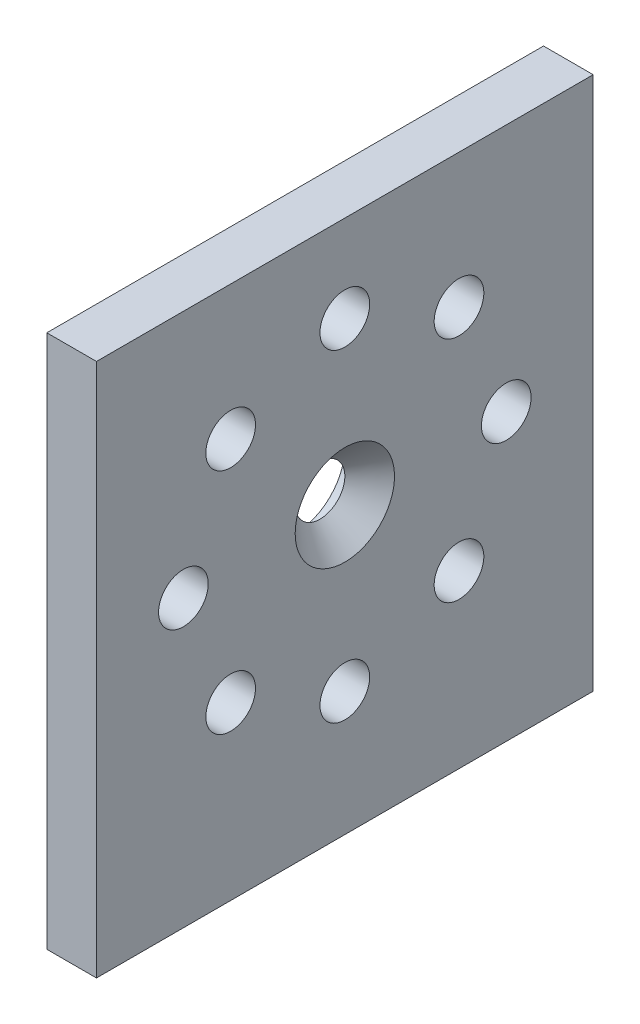
ISO-10303-21;
HEADER;
FILE_DESCRIPTION(('STEP AP214'),'2;1');
FILE_NAME('part.step','',(''),(''),'','','');
FILE_SCHEMA(('AUTOMOTIVE_DESIGN { 1 0 10303 214 1 1 1 1 }'));
ENDSEC;
DATA;
#1=APPLICATION_CONTEXT('core data for automotive mechanical design processes');
#2=APPLICATION_PROTOCOL_DEFINITION('international standard','automotive_design',2000,#1);
#3=PRODUCT_CONTEXT('',#1,'mechanical');
#4=PRODUCT('Part','Part','',(#3));
#5=PRODUCT_RELATED_PRODUCT_CATEGORY('part','',(#4));
#6=PRODUCT_DEFINITION_FORMATION('','',#4);
#7=PRODUCT_DEFINITION_CONTEXT('part definition',#1,'design');
#8=PRODUCT_DEFINITION('design','',#6,#7);
#9=PRODUCT_DEFINITION_SHAPE('','',#8);
#10=(LENGTH_UNIT() NAMED_UNIT(*) SI_UNIT(.MILLI.,.METRE.));
#11=(NAMED_UNIT(*) PLANE_ANGLE_UNIT() SI_UNIT($,.RADIAN.));
#12=(NAMED_UNIT(*) SI_UNIT($,.STERADIAN.) SOLID_ANGLE_UNIT());
#13=UNCERTAINTY_MEASURE_WITH_UNIT(LENGTH_MEASURE(1.E-05),#10,'distance_accuracy_value','');
#14=(GEOMETRIC_REPRESENTATION_CONTEXT(3) GLOBAL_UNCERTAINTY_ASSIGNED_CONTEXT((#13)) GLOBAL_UNIT_ASSIGNED_CONTEXT((#10,
#11,#12)) REPRESENTATION_CONTEXT('',''));
#15=CARTESIAN_POINT('',(0.,0.,0.));
#16=DIRECTION('',(0.,0.,1.));
#17=DIRECTION('',(1.,0.,0.));
#18=AXIS2_PLACEMENT_3D('',#15,#16,#17);
#19=CARTESIAN_POINT('',(0.,0.,40.));
#20=DIRECTION('',(0.,1.,0.));
#21=DIRECTION('',(0.,0.,1.));
#22=AXIS2_PLACEMENT_3D('',#19,#20,#21);
#23=PLANE('',#22);
#24=DIRECTION('',(1.,0.,0.));
#25=VECTOR('',#24,1.);
#26=CARTESIAN_POINT('',(0.,0.,0.));
#27=LINE('',#26,#25);
#28=CARTESIAN_POINT('',(0.,0.,0.));
#29=VERTEX_POINT('',#28);
#30=CARTESIAN_POINT('',(4.,0.,0.));
#31=VERTEX_POINT('',#30);
#32=EDGE_CURVE('E98',#29,#31,#27,.T.);
#33=ORIENTED_EDGE('',*,*,#32,.T.);
#34=DIRECTION('',(0.,0.,-1.));
#35=VECTOR('',#34,1.);
#36=CARTESIAN_POINT('',(4.,0.,40.));
#37=LINE('',#36,#35);
#38=CARTESIAN_POINT('',(4.,0.,40.));
#39=VERTEX_POINT('',#38);
#40=EDGE_CURVE('E40',#39,#31,#37,.T.);
#41=ORIENTED_EDGE('',*,*,#40,.F.);
#42=DIRECTION('',(1.,0.,0.));
#43=VECTOR('',#42,1.);
#44=CARTESIAN_POINT('',(0.,0.,40.));
#45=LINE('',#44,#43);
#46=CARTESIAN_POINT('',(0.,0.,40.));
#47=VERTEX_POINT('',#46);
#48=EDGE_CURVE('E84',#47,#39,#45,.T.);
#49=ORIENTED_EDGE('',*,*,#48,.F.);
#50=DIRECTION('',(0.,0.,-1.));
#51=VECTOR('',#50,1.);
#52=CARTESIAN_POINT('',(0.,0.,40.));
#53=LINE('',#52,#51);
#54=EDGE_CURVE('E94',#47,#29,#53,.T.);
#55=ORIENTED_EDGE('',*,*,#54,.T.);
#56=EDGE_LOOP('',(#33,#41,#49,#55));
#57=FACE_BOUND('',#56,.T.);
#58=ADVANCED_FACE('F31',(#57),#23,.F.);
#59=CARTESIAN_POINT('',(4.,0.,40.));
#60=DIRECTION('',(-1.,0.,0.));
#61=DIRECTION('',(0.,0.,1.));
#62=AXIS2_PLACEMENT_3D('',#59,#60,#61);
#63=PLANE('',#62);
#64=CARTESIAN_POINT('',(4.,23.,20.));
#65=DIRECTION('',(-1.,0.,0.));
#66=DIRECTION('',(0.,0.,1.));
#67=AXIS2_PLACEMENT_3D('',#64,#65,#66);
#68=CIRCLE('',#67,4.);
#69=CARTESIAN_POINT('',(4.,23.,24.));
#70=VERTEX_POINT('',#69);
#71=EDGE_CURVE('E11',#70,#70,#68,.T.);
#72=ORIENTED_EDGE('',*,*,#71,.T.);
#73=EDGE_LOOP('',(#72));
#74=FACE_BOUND('',#73,.T.);
#75=CARTESIAN_POINT('',(4.,32.1923881554251,10.8076118445749));
#76=DIRECTION('',(-1.,0.,0.));
#77=DIRECTION('',(0.,0.,1.));
#78=AXIS2_PLACEMENT_3D('',#75,#76,#77);
#79=CIRCLE('',#78,2.00000000000001);
#80=CARTESIAN_POINT('',(4.,32.1923881554251,12.8076118445749));
#81=VERTEX_POINT('',#80);
#82=EDGE_CURVE('E114',#81,#81,#79,.T.);
#83=ORIENTED_EDGE('',*,*,#82,.T.);
#84=EDGE_LOOP('',(#83));
#85=FACE_BOUND('',#84,.T.);
#86=CARTESIAN_POINT('',(4.,23.,7.));
#87=DIRECTION('',(-1.,0.,0.));
#88=DIRECTION('',(0.,0.,1.));
#89=AXIS2_PLACEMENT_3D('',#86,#87,#88);
#90=CIRCLE('',#89,2.);
#91=CARTESIAN_POINT('',(4.,23.,8.99999999999999));
#92=VERTEX_POINT('',#91);
#93=EDGE_CURVE('E127',#92,#92,#90,.T.);
#94=ORIENTED_EDGE('',*,*,#93,.T.);
#95=EDGE_LOOP('',(#94));
#96=FACE_BOUND('',#95,.T.);
#97=CARTESIAN_POINT('',(4.,13.8076118445749,10.8076118445749));
#98=DIRECTION('',(-1.,0.,0.));
#99=DIRECTION('',(0.,0.,1.));
#100=AXIS2_PLACEMENT_3D('',#97,#98,#99);
#101=CIRCLE('',#100,2.);
#102=CARTESIAN_POINT('',(4.,13.8076118445749,12.8076118445749));
#103=VERTEX_POINT('',#102);
#104=EDGE_CURVE('E133',#103,#103,#101,.T.);
#105=ORIENTED_EDGE('',*,*,#104,.T.);
#106=EDGE_LOOP('',(#105));
#107=FACE_BOUND('',#106,.T.);
#108=CARTESIAN_POINT('',(4.,9.99999999999999,20.));
#109=DIRECTION('',(-1.,0.,0.));
#110=DIRECTION('',(0.,0.,1.));
#111=AXIS2_PLACEMENT_3D('',#108,#109,#110);
#112=CIRCLE('',#111,2.00000000000001);
#113=CARTESIAN_POINT('',(4.,9.99999999999999,22.));
#114=VERTEX_POINT('',#113);
#115=EDGE_CURVE('E139',#114,#114,#112,.T.);
#116=ORIENTED_EDGE('',*,*,#115,.T.);
#117=EDGE_LOOP('',(#116));
#118=FACE_BOUND('',#117,.T.);
#119=CARTESIAN_POINT('',(4.,13.8076118445749,29.1923881554251));
#120=DIRECTION('',(-1.,0.,0.));
#121=DIRECTION('',(0.,0.,1.));
#122=AXIS2_PLACEMENT_3D('',#119,#120,#121);
#123=CIRCLE('',#122,2.00000000000001);
#124=CARTESIAN_POINT('',(4.,13.8076118445749,31.1923881554251));
#125=VERTEX_POINT('',#124);
#126=EDGE_CURVE('E145',#125,#125,#123,.T.);
#127=ORIENTED_EDGE('',*,*,#126,.T.);
#128=EDGE_LOOP('',(#127));
#129=FACE_BOUND('',#128,.T.);
#130=CARTESIAN_POINT('',(4.,23.,33.));
#131=DIRECTION('',(-1.,0.,0.));
#132=DIRECTION('',(0.,0.,1.));
#133=AXIS2_PLACEMENT_3D('',#130,#131,#132);
#134=CIRCLE('',#133,2.);
#135=CARTESIAN_POINT('',(4.,23.,35.));
#136=VERTEX_POINT('',#135);
#137=EDGE_CURVE('E151',#136,#136,#134,.T.);
#138=ORIENTED_EDGE('',*,*,#137,.T.);
#139=EDGE_LOOP('',(#138));
#140=FACE_BOUND('',#139,.T.);
#141=CARTESIAN_POINT('',(4.,32.1923881554251,29.1923881554251));
#142=DIRECTION('',(-1.,0.,0.));
#143=DIRECTION('',(0.,0.,1.));
#144=AXIS2_PLACEMENT_3D('',#141,#142,#143);
#145=CIRCLE('',#144,2.);
#146=CARTESIAN_POINT('',(4.,32.1923881554251,31.1923881554251));
#147=VERTEX_POINT('',#146);
#148=EDGE_CURVE('E157',#147,#147,#145,.T.);
#149=ORIENTED_EDGE('',*,*,#148,.T.);
#150=EDGE_LOOP('',(#149));
#151=FACE_BOUND('',#150,.T.);
#152=CARTESIAN_POINT('',(4.,36.,20.));
#153=DIRECTION('',(-1.,0.,0.));
#154=DIRECTION('',(0.,0.,1.));
#155=AXIS2_PLACEMENT_3D('',#152,#153,#154);
#156=CIRCLE('',#155,2.);
#157=CARTESIAN_POINT('',(4.,36.,22.));
#158=VERTEX_POINT('',#157);
#159=EDGE_CURVE('E101',#158,#158,#156,.T.);
#160=ORIENTED_EDGE('',*,*,#159,.T.);
#161=EDGE_LOOP('',(#160));
#162=FACE_BOUND('',#161,.T.);
#163=DIRECTION('',(0.,1.,0.));
#164=VECTOR('',#163,1.);
#165=CARTESIAN_POINT('',(4.,0.,0.));
#166=LINE('',#165,#164);
#167=CARTESIAN_POINT('',(4.,43.,0.));
#168=VERTEX_POINT('',#167);
#169=EDGE_CURVE('E89',#31,#168,#166,.T.);
#170=ORIENTED_EDGE('',*,*,#169,.T.);
#171=DIRECTION('',(0.,0.,-1.));
#172=VECTOR('',#171,1.);
#173=CARTESIAN_POINT('',(4.,43.,40.));
#174=LINE('',#173,#172);
#175=CARTESIAN_POINT('',(4.,43.,40.));
#176=VERTEX_POINT('',#175);
#177=EDGE_CURVE('E87',#176,#168,#174,.T.);
#178=ORIENTED_EDGE('',*,*,#177,.F.);
#179=DIRECTION('',(0.,1.,0.));
#180=VECTOR('',#179,1.);
#181=CARTESIAN_POINT('',(4.,0.,40.));
#182=LINE('',#181,#180);
#183=EDGE_CURVE('E79',#39,#176,#182,.T.);
#184=ORIENTED_EDGE('',*,*,#183,.F.);
#185=ORIENTED_EDGE('',*,*,#40,.T.);
#186=EDGE_LOOP('',(#170,#178,#184,#185));
#187=FACE_BOUND('',#186,.T.);
#188=ADVANCED_FACE('F88',(#74,#85,#96,#107,#118,#129,#140,#151,#162,#187),#63,.F.);
#189=CARTESIAN_POINT('',(4.,43.,40.));
#190=DIRECTION('',(0.,-1.,0.));
#191=DIRECTION('',(0.,0.,-1.));
#192=AXIS2_PLACEMENT_3D('',#189,#190,#191);
#193=PLANE('',#192);
#194=DIRECTION('',(-1.,0.,0.));
#195=VECTOR('',#194,1.);
#196=CARTESIAN_POINT('',(4.,43.,0.));
#197=LINE('',#196,#195);
#198=CARTESIAN_POINT('',(0.,43.,0.));
#199=VERTEX_POINT('',#198);
#200=EDGE_CURVE('E65',#168,#199,#197,.T.);
#201=ORIENTED_EDGE('',*,*,#200,.T.);
#202=DIRECTION('',(0.,0.,-1.));
#203=VECTOR('',#202,1.);
#204=CARTESIAN_POINT('',(0.,43.,40.));
#205=LINE('',#204,#203);
#206=CARTESIAN_POINT('',(0.,43.,40.));
#207=VERTEX_POINT('',#206);
#208=EDGE_CURVE('E90',#207,#199,#205,.T.);
#209=ORIENTED_EDGE('',*,*,#208,.F.);
#210=DIRECTION('',(-1.,0.,0.));
#211=VECTOR('',#210,1.);
#212=CARTESIAN_POINT('',(4.,43.,40.));
#213=LINE('',#212,#211);
#214=EDGE_CURVE('E82',#176,#207,#213,.T.);
#215=ORIENTED_EDGE('',*,*,#214,.F.);
#216=ORIENTED_EDGE('',*,*,#177,.T.);
#217=EDGE_LOOP('',(#201,#209,#215,#216));
#218=FACE_BOUND('',#217,.T.);
#219=ADVANCED_FACE('F92',(#218),#193,.F.);
#220=CARTESIAN_POINT('',(0.,0.,40.));
#221=DIRECTION('',(1.,0.,0.));
#222=DIRECTION('',(0.,0.,-1.));
#223=AXIS2_PLACEMENT_3D('',#220,#221,#222);
#224=PLANE('',#223);
#225=CARTESIAN_POINT('',(0.,23.,20.));
#226=DIRECTION('',(-1.,0.,0.));
#227=DIRECTION('',(0.,0.,1.));
#228=AXIS2_PLACEMENT_3D('',#225,#226,#227);
#229=CIRCLE('',#228,4.);
#230=CARTESIAN_POINT('',(0.,23.,24.));
#231=VERTEX_POINT('',#230);
#232=EDGE_CURVE('E117',#231,#231,#229,.T.);
#233=ORIENTED_EDGE('',*,*,#232,.F.);
#234=EDGE_LOOP('',(#233));
#235=FACE_BOUND('',#234,.T.);
#236=CARTESIAN_POINT('',(0.,32.1923881554251,10.8076118445749));
#237=DIRECTION('',(-1.,0.,0.));
#238=DIRECTION('',(0.,0.,1.));
#239=AXIS2_PLACEMENT_3D('',#236,#237,#238);
#240=CIRCLE('',#239,2.00000000000001);
#241=CARTESIAN_POINT('',(0.,32.1923881554251,12.8076118445749));
#242=VERTEX_POINT('',#241);
#243=EDGE_CURVE('E109',#242,#242,#240,.T.);
#244=ORIENTED_EDGE('',*,*,#243,.F.);
#245=EDGE_LOOP('',(#244));
#246=FACE_BOUND('',#245,.T.);
#247=CARTESIAN_POINT('',(0.,23.,7.));
#248=DIRECTION('',(-1.,0.,0.));
#249=DIRECTION('',(0.,0.,1.));
#250=AXIS2_PLACEMENT_3D('',#247,#248,#249);
#251=CIRCLE('',#250,2.);
#252=CARTESIAN_POINT('',(0.,23.,8.99999999999999));
#253=VERTEX_POINT('',#252);
#254=EDGE_CURVE('E125',#253,#253,#251,.T.);
#255=ORIENTED_EDGE('',*,*,#254,.F.);
#256=EDGE_LOOP('',(#255));
#257=FACE_BOUND('',#256,.T.);
#258=CARTESIAN_POINT('',(0.,13.8076118445749,10.8076118445749));
#259=DIRECTION('',(-1.,0.,0.));
#260=DIRECTION('',(0.,0.,1.));
#261=AXIS2_PLACEMENT_3D('',#258,#259,#260);
#262=CIRCLE('',#261,2.);
#263=CARTESIAN_POINT('',(0.,13.8076118445749,12.8076118445749));
#264=VERTEX_POINT('',#263);
#265=EDGE_CURVE('E130',#264,#264,#262,.T.);
#266=ORIENTED_EDGE('',*,*,#265,.F.);
#267=EDGE_LOOP('',(#266));
#268=FACE_BOUND('',#267,.T.);
#269=CARTESIAN_POINT('',(0.,9.99999999999999,20.));
#270=DIRECTION('',(-1.,0.,0.));
#271=DIRECTION('',(0.,0.,1.));
#272=AXIS2_PLACEMENT_3D('',#269,#270,#271);
#273=CIRCLE('',#272,2.00000000000001);
#274=CARTESIAN_POINT('',(0.,9.99999999999999,22.));
#275=VERTEX_POINT('',#274);
#276=EDGE_CURVE('E136',#275,#275,#273,.T.);
#277=ORIENTED_EDGE('',*,*,#276,.F.);
#278=EDGE_LOOP('',(#277));
#279=FACE_BOUND('',#278,.T.);
#280=CARTESIAN_POINT('',(0.,13.8076118445749,29.1923881554251));
#281=DIRECTION('',(-1.,0.,0.));
#282=DIRECTION('',(0.,0.,1.));
#283=AXIS2_PLACEMENT_3D('',#280,#281,#282);
#284=CIRCLE('',#283,2.00000000000001);
#285=CARTESIAN_POINT('',(0.,13.8076118445749,31.1923881554251));
#286=VERTEX_POINT('',#285);
#287=EDGE_CURVE('E142',#286,#286,#284,.T.);
#288=ORIENTED_EDGE('',*,*,#287,.F.);
#289=EDGE_LOOP('',(#288));
#290=FACE_BOUND('',#289,.T.);
#291=CARTESIAN_POINT('',(0.,23.,33.));
#292=DIRECTION('',(-1.,0.,0.));
#293=DIRECTION('',(0.,0.,1.));
#294=AXIS2_PLACEMENT_3D('',#291,#292,#293);
#295=CIRCLE('',#294,2.);
#296=CARTESIAN_POINT('',(0.,23.,35.));
#297=VERTEX_POINT('',#296);
#298=EDGE_CURVE('E148',#297,#297,#295,.T.);
#299=ORIENTED_EDGE('',*,*,#298,.F.);
#300=EDGE_LOOP('',(#299));
#301=FACE_BOUND('',#300,.T.);
#302=CARTESIAN_POINT('',(0.,32.1923881554251,29.1923881554251));
#303=DIRECTION('',(-1.,0.,0.));
#304=DIRECTION('',(0.,0.,1.));
#305=AXIS2_PLACEMENT_3D('',#302,#303,#304);
#306=CIRCLE('',#305,2.);
#307=CARTESIAN_POINT('',(0.,32.1923881554251,31.1923881554251));
#308=VERTEX_POINT('',#307);
#309=EDGE_CURVE('E154',#308,#308,#306,.T.);
#310=ORIENTED_EDGE('',*,*,#309,.F.);
#311=EDGE_LOOP('',(#310));
#312=FACE_BOUND('',#311,.T.);
#313=CARTESIAN_POINT('',(0.,36.,20.));
#314=DIRECTION('',(-1.,0.,0.));
#315=DIRECTION('',(0.,0.,1.));
#316=AXIS2_PLACEMENT_3D('',#313,#314,#315);
#317=CIRCLE('',#316,2.);
#318=CARTESIAN_POINT('',(0.,36.,22.));
#319=VERTEX_POINT('',#318);
#320=EDGE_CURVE('E160',#319,#319,#317,.T.);
#321=ORIENTED_EDGE('',*,*,#320,.F.);
#322=EDGE_LOOP('',(#321));
#323=FACE_BOUND('',#322,.T.);
#324=DIRECTION('',(0.,-1.,0.));
#325=VECTOR('',#324,1.);
#326=CARTESIAN_POINT('',(0.,0.,0.));
#327=LINE('',#326,#325);
#328=EDGE_CURVE('E71',#199,#29,#327,.T.);
#329=ORIENTED_EDGE('',*,*,#328,.T.);
#330=ORIENTED_EDGE('',*,*,#54,.F.);
#331=DIRECTION('',(0.,-1.,0.));
#332=VECTOR('',#331,1.);
#333=CARTESIAN_POINT('',(0.,0.,40.));
#334=LINE('',#333,#332);
#335=EDGE_CURVE('E48',#207,#47,#334,.T.);
#336=ORIENTED_EDGE('',*,*,#335,.F.);
#337=ORIENTED_EDGE('',*,*,#208,.T.);
#338=EDGE_LOOP('',(#329,#330,#336,#337));
#339=FACE_BOUND('',#338,.T.);
#340=ADVANCED_FACE('F170',(#235,#246,#257,#268,#279,#290,#301,#312,#323,#339),#224,.F.);
#341=CARTESIAN_POINT('',(4.,0.,40.));
#342=DIRECTION('',(0.,0.,1.));
#343=DIRECTION('',(1.,0.,0.));
#344=AXIS2_PLACEMENT_3D('',#341,#342,#343);
#345=PLANE('',#344);
#346=ORIENTED_EDGE('',*,*,#48,.T.);
#347=ORIENTED_EDGE('',*,*,#183,.T.);
#348=ORIENTED_EDGE('',*,*,#214,.T.);
#349=ORIENTED_EDGE('',*,*,#335,.T.);
#350=EDGE_LOOP('',(#346,#347,#348,#349));
#351=FACE_BOUND('',#350,.T.);
#352=ADVANCED_FACE('F80',(#351),#345,.T.);
#353=CARTESIAN_POINT('',(4.,0.,0.));
#354=DIRECTION('',(0.,0.,1.));
#355=DIRECTION('',(1.,0.,0.));
#356=AXIS2_PLACEMENT_3D('',#353,#354,#355);
#357=PLANE('',#356);
#358=ORIENTED_EDGE('',*,*,#32,.F.);
#359=ORIENTED_EDGE('',*,*,#328,.F.);
#360=ORIENTED_EDGE('',*,*,#200,.F.);
#361=ORIENTED_EDGE('',*,*,#169,.F.);
#362=EDGE_LOOP('',(#358,#359,#360,#361));
#363=FACE_BOUND('',#362,.T.);
#364=ADVANCED_FACE('F178',(#363),#357,.F.);
#365=CARTESIAN_POINT('',(4.,36.,20.));
#366=DIRECTION('',(-1.,0.,0.));
#367=DIRECTION('',(0.,0.,1.));
#368=AXIS2_PLACEMENT_3D('',#365,#366,#367);
#369=CYLINDRICAL_SURFACE('',#368,2.);
#370=ORIENTED_EDGE('',*,*,#159,.F.);
#371=EDGE_LOOP('',(#370));
#372=FACE_BOUND('',#371,.T.);
#373=ORIENTED_EDGE('',*,*,#320,.T.);
#374=EDGE_LOOP('',(#373));
#375=FACE_BOUND('',#374,.T.);
#376=ADVANCED_FACE('F168',(#372,#375),#369,.F.);
#377=CARTESIAN_POINT('',(4.,32.1923881554251,29.1923881554251));
#378=DIRECTION('',(-1.,0.,0.));
#379=DIRECTION('',(0.,0.,1.));
#380=AXIS2_PLACEMENT_3D('',#377,#378,#379);
#381=CYLINDRICAL_SURFACE('',#380,2.);
#382=ORIENTED_EDGE('',*,*,#148,.F.);
#383=EDGE_LOOP('',(#382));
#384=FACE_BOUND('',#383,.T.);
#385=ORIENTED_EDGE('',*,*,#309,.T.);
#386=EDGE_LOOP('',(#385));
#387=FACE_BOUND('',#386,.T.);
#388=ADVANCED_FACE('F197',(#384,#387),#381,.F.);
#389=CARTESIAN_POINT('',(4.,23.,33.));
#390=DIRECTION('',(-1.,0.,0.));
#391=DIRECTION('',(0.,0.,1.));
#392=AXIS2_PLACEMENT_3D('',#389,#390,#391);
#393=CYLINDRICAL_SURFACE('',#392,2.);
#394=ORIENTED_EDGE('',*,*,#137,.F.);
#395=EDGE_LOOP('',(#394));
#396=FACE_BOUND('',#395,.T.);
#397=ORIENTED_EDGE('',*,*,#298,.T.);
#398=EDGE_LOOP('',(#397));
#399=FACE_BOUND('',#398,.T.);
#400=ADVANCED_FACE('F203',(#396,#399),#393,.F.);
#401=CARTESIAN_POINT('',(4.,13.8076118445749,29.1923881554251));
#402=DIRECTION('',(-1.,0.,0.));
#403=DIRECTION('',(0.,0.,1.));
#404=AXIS2_PLACEMENT_3D('',#401,#402,#403);
#405=CYLINDRICAL_SURFACE('',#404,2.00000000000001);
#406=ORIENTED_EDGE('',*,*,#126,.F.);
#407=EDGE_LOOP('',(#406));
#408=FACE_BOUND('',#407,.T.);
#409=ORIENTED_EDGE('',*,*,#287,.T.);
#410=EDGE_LOOP('',(#409));
#411=FACE_BOUND('',#410,.T.);
#412=ADVANCED_FACE('F207',(#408,#411),#405,.F.);
#413=CARTESIAN_POINT('',(4.,9.99999999999999,20.));
#414=DIRECTION('',(-1.,0.,0.));
#415=DIRECTION('',(0.,0.,1.));
#416=AXIS2_PLACEMENT_3D('',#413,#414,#415);
#417=CYLINDRICAL_SURFACE('',#416,2.00000000000001);
#418=ORIENTED_EDGE('',*,*,#115,.F.);
#419=EDGE_LOOP('',(#418));
#420=FACE_BOUND('',#419,.T.);
#421=ORIENTED_EDGE('',*,*,#276,.T.);
#422=EDGE_LOOP('',(#421));
#423=FACE_BOUND('',#422,.T.);
#424=ADVANCED_FACE('F211',(#420,#423),#417,.F.);
#425=CARTESIAN_POINT('',(4.,13.8076118445749,10.8076118445749));
#426=DIRECTION('',(-1.,0.,0.));
#427=DIRECTION('',(0.,0.,1.));
#428=AXIS2_PLACEMENT_3D('',#425,#426,#427);
#429=CYLINDRICAL_SURFACE('',#428,2.);
#430=ORIENTED_EDGE('',*,*,#104,.F.);
#431=EDGE_LOOP('',(#430));
#432=FACE_BOUND('',#431,.T.);
#433=ORIENTED_EDGE('',*,*,#265,.T.);
#434=EDGE_LOOP('',(#433));
#435=FACE_BOUND('',#434,.T.);
#436=ADVANCED_FACE('F215',(#432,#435),#429,.F.);
#437=CARTESIAN_POINT('',(4.,23.,7.));
#438=DIRECTION('',(-1.,0.,0.));
#439=DIRECTION('',(0.,0.,1.));
#440=AXIS2_PLACEMENT_3D('',#437,#438,#439);
#441=CYLINDRICAL_SURFACE('',#440,2.);
#442=ORIENTED_EDGE('',*,*,#93,.F.);
#443=EDGE_LOOP('',(#442));
#444=FACE_BOUND('',#443,.T.);
#445=ORIENTED_EDGE('',*,*,#254,.T.);
#446=EDGE_LOOP('',(#445));
#447=FACE_BOUND('',#446,.T.);
#448=ADVANCED_FACE('F219',(#444,#447),#441,.F.);
#449=CARTESIAN_POINT('',(4.,32.1923881554251,10.8076118445749));
#450=DIRECTION('',(-1.,0.,0.));
#451=DIRECTION('',(0.,0.,1.));
#452=AXIS2_PLACEMENT_3D('',#449,#450,#451);
#453=CYLINDRICAL_SURFACE('',#452,2.00000000000001);
#454=ORIENTED_EDGE('',*,*,#82,.F.);
#455=EDGE_LOOP('',(#454));
#456=FACE_BOUND('',#455,.T.);
#457=ORIENTED_EDGE('',*,*,#243,.T.);
#458=EDGE_LOOP('',(#457));
#459=FACE_BOUND('',#458,.T.);
#460=ADVANCED_FACE('F223',(#456,#459),#453,.F.);
#461=CARTESIAN_POINT('',(2.,23.,20.));
#462=DIRECTION('',(-1.,0.,0.));
#463=DIRECTION('',(0.,0.,1.));
#464=AXIS2_PLACEMENT_3D('',#461,#462,#463);
#465=PLANE('',#464);
#466=CARTESIAN_POINT('',(2.,23.,20.));
#467=DIRECTION('',(-1.,0.,0.));
#468=DIRECTION('',(0.,0.,1.));
#469=AXIS2_PLACEMENT_3D('',#466,#467,#468);
#470=CIRCLE('',#469,4.);
#471=CARTESIAN_POINT('',(2.,23.,24.));
#472=VERTEX_POINT('',#471);
#473=EDGE_CURVE('E110',#472,#472,#470,.T.);
#474=ORIENTED_EDGE('',*,*,#473,.T.);
#475=EDGE_LOOP('',(#474));
#476=FACE_BOUND('',#475,.T.);
#477=CARTESIAN_POINT('',(2.,23.,20.));
#478=DIRECTION('',(-1.,0.,0.));
#479=DIRECTION('',(0.,0.,1.));
#480=AXIS2_PLACEMENT_3D('',#477,#478,#479);
#481=CIRCLE('',#480,2.);
#482=CARTESIAN_POINT('',(2.,23.,22.));
#483=VERTEX_POINT('',#482);
#484=EDGE_CURVE('E107',#483,#483,#481,.F.);
#485=ORIENTED_EDGE('',*,*,#484,.T.);
#486=EDGE_LOOP('',(#485));
#487=FACE_BOUND('',#486,.T.);
#488=ADVANCED_FACE('F227',(#476,#487),#465,.T.);
#489=CARTESIAN_POINT('',(2.,23.,20.));
#490=DIRECTION('',(-1.,0.,0.));
#491=DIRECTION('',(0.,0.,1.));
#492=AXIS2_PLACEMENT_3D('',#489,#490,#491);
#493=CYLINDRICAL_SURFACE('',#492,4.);
#494=ORIENTED_EDGE('',*,*,#473,.F.);
#495=EDGE_LOOP('',(#494));
#496=FACE_BOUND('',#495,.T.);
#497=ORIENTED_EDGE('',*,*,#232,.T.);
#498=EDGE_LOOP('',(#497));
#499=FACE_BOUND('',#498,.T.);
#500=ADVANCED_FACE('F229',(#496,#499),#493,.F.);
#501=CARTESIAN_POINT('',(4.,23.,20.));
#502=DIRECTION('',(1.,0.,0.));
#503=DIRECTION('',(0.,0.,-1.));
#504=AXIS2_PLACEMENT_3D('',#501,#502,#503);
#505=CONICAL_SURFACE('',#504,4.,0.785398163397446);
#506=ORIENTED_EDGE('',*,*,#484,.F.);
#507=EDGE_LOOP('',(#506));
#508=FACE_BOUND('',#507,.T.);
#509=ORIENTED_EDGE('',*,*,#71,.F.);
#510=EDGE_LOOP('',(#509));
#511=FACE_BOUND('',#510,.T.);
#512=ADVANCED_FACE('F33',(#508,#511),#505,.F.);
#513=CLOSED_SHELL('',(#58,#188,#219,#340,#352,#364,#376,#388,#400,#412,#424,#436,#448,#460,#488,
#500,#512));
#514=MANIFOLD_SOLID_BREP('B2',#513);
#515=ADVANCED_BREP_SHAPE_REPRESENTATION('',(#18,#514),#14);
#516=SHAPE_DEFINITION_REPRESENTATION(#9,#515);
ENDSEC;
END-ISO-10303-21;
